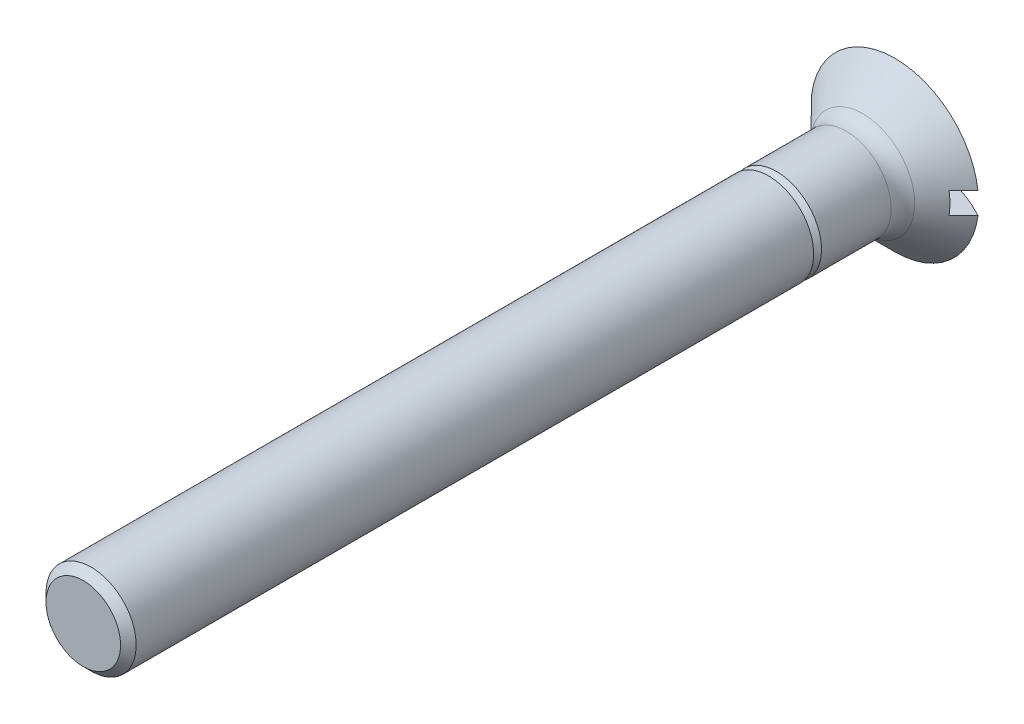
ISO-10303-21;
HEADER;
FILE_DESCRIPTION(('STEP AP214'),'2;1');
FILE_NAME('part.step','',(''),(''),'','','');
FILE_SCHEMA(('AUTOMOTIVE_DESIGN { 1 0 10303 214 1 1 1 1 }'));
ENDSEC;
DATA;
#1=APPLICATION_CONTEXT('core data for automotive mechanical design processes');
#2=APPLICATION_PROTOCOL_DEFINITION('international standard','automotive_design',2000,#1);
#3=PRODUCT_CONTEXT('',#1,'mechanical');
#4=PRODUCT('Part','Part','',(#3));
#5=PRODUCT_RELATED_PRODUCT_CATEGORY('part','',(#4));
#6=PRODUCT_DEFINITION_FORMATION('','',#4);
#7=PRODUCT_DEFINITION_CONTEXT('part definition',#1,'design');
#8=PRODUCT_DEFINITION('design','',#6,#7);
#9=PRODUCT_DEFINITION_SHAPE('','',#8);
#10=(LENGTH_UNIT() NAMED_UNIT(*) SI_UNIT(.MILLI.,.METRE.));
#11=(NAMED_UNIT(*) PLANE_ANGLE_UNIT() SI_UNIT($,.RADIAN.));
#12=(NAMED_UNIT(*) SI_UNIT($,.STERADIAN.) SOLID_ANGLE_UNIT());
#13=UNCERTAINTY_MEASURE_WITH_UNIT(LENGTH_MEASURE(1.E-05),#10,'distance_accuracy_value','');
#14=(GEOMETRIC_REPRESENTATION_CONTEXT(3) GLOBAL_UNCERTAINTY_ASSIGNED_CONTEXT((#13)) GLOBAL_UNIT_ASSIGNED_CONTEXT((#10,
#11,#12)) REPRESENTATION_CONTEXT('',''));
#15=CARTESIAN_POINT('',(0.,0.,0.));
#16=DIRECTION('',(0.,0.,1.));
#17=DIRECTION('',(1.,0.,0.));
#18=AXIS2_PLACEMENT_3D('',#15,#16,#17);
#19=CARTESIAN_POINT('',(0.,0.,9.609375));
#20=DIRECTION('',(0.,0.,-1.));
#21=DIRECTION('',(0.,1.,0.));
#22=AXIS2_PLACEMENT_3D('',#19,#20,#21);
#23=SPHERICAL_SURFACE('',#22,9.609375);
#24=CARTESIAN_POINT('',(0.,0.,1.2));
#25=DIRECTION('',(0.,0.,-1.));
#26=DIRECTION('',(-1.,0.,0.));
#27=AXIS2_PLACEMENT_3D('',#24,#25,#26);
#28=CIRCLE('',#27,4.65);
#29=CARTESIAN_POINT('',(4.61112784468182,-0.6,1.2));
#30=VERTEX_POINT('',#29);
#31=CARTESIAN_POINT('',(-4.61112784468182,-0.6,1.2));
#32=VERTEX_POINT('',#31);
#33=EDGE_CURVE('E125',#30,#32,#28,.T.);
#34=ORIENTED_EDGE('',*,*,#33,.T.);
#35=CARTESIAN_POINT('',(0.,-0.6,9.609375));
#36=DIRECTION('',(0.,-1.,0.));
#37=DIRECTION('',(1.,0.,0.));
#38=AXIS2_PLACEMENT_3D('',#35,#36,#37);
#39=CIRCLE('',#38,9.590625);
#40=EDGE_CURVE('E81',#32,#30,#39,.T.);
#41=ORIENTED_EDGE('',*,*,#40,.T.);
#42=EDGE_LOOP('',(#34,#41));
#43=FACE_BOUND('',#42,.T.);
#44=ADVANCED_FACE('F16',(#43),#23,.T.);
#45=CARTESIAN_POINT('',(0.,0.,46.2));
#46=DIRECTION('',(0.,0.,-1.));
#47=DIRECTION('',(-1.,0.,0.));
#48=AXIS2_PLACEMENT_3D('',#45,#46,#47);
#49=PLANE('',#48);
#50=CARTESIAN_POINT('',(0.,0.,46.2));
#51=DIRECTION('',(0.,0.,-1.));
#52=DIRECTION('',(-1.,0.,0.));
#53=AXIS2_PLACEMENT_3D('',#50,#51,#52);
#54=CIRCLE('',#53,2.067);
#55=CARTESIAN_POINT('',(-2.067,0.,46.2));
#56=VERTEX_POINT('',#55);
#57=EDGE_CURVE('E92',#56,#56,#54,.T.);
#58=ORIENTED_EDGE('',*,*,#57,.F.);
#59=EDGE_LOOP('',(#58));
#60=FACE_BOUND('',#59,.T.);
#61=ADVANCED_FACE('F18',(#60),#49,.F.);
#62=CARTESIAN_POINT('',(0.,0.,46.2));
#63=DIRECTION('',(0.,0.,-1.));
#64=DIRECTION('',(-1.,0.,0.));
#65=AXIS2_PLACEMENT_3D('',#62,#63,#64);
#66=CONICAL_SURFACE('',#65,2.067,0.785398163397455);
#67=CARTESIAN_POINT('',(0.,0.,45.767));
#68=DIRECTION('',(0.,0.,-1.));
#69=DIRECTION('',(-1.,0.,0.));
#70=AXIS2_PLACEMENT_3D('',#67,#68,#69);
#71=CIRCLE('',#70,2.5);
#72=CARTESIAN_POINT('',(-2.5,0.,45.767));
#73=VERTEX_POINT('',#72);
#74=EDGE_CURVE('E98',#73,#73,#71,.T.);
#75=ORIENTED_EDGE('',*,*,#74,.F.);
#76=EDGE_LOOP('',(#75));
#77=FACE_BOUND('',#76,.T.);
#78=ORIENTED_EDGE('',*,*,#57,.T.);
#79=EDGE_LOOP('',(#78));
#80=FACE_BOUND('',#79,.T.);
#81=ADVANCED_FACE('F157',(#77,#80),#66,.T.);
#82=CARTESIAN_POINT('',(0.,0.,0.));
#83=DIRECTION('',(0.,0.,-1.));
#84=DIRECTION('',(-1.,0.,0.));
#85=AXIS2_PLACEMENT_3D('',#82,#83,#84);
#86=CYLINDRICAL_SURFACE('',#85,2.5);
#87=CARTESIAN_POINT('',(0.,0.,8.2));
#88=DIRECTION('',(0.,0.,-1.));
#89=DIRECTION('',(-1.,0.,0.));
#90=AXIS2_PLACEMENT_3D('',#87,#88,#89);
#91=CIRCLE('',#90,2.5);
#92=CARTESIAN_POINT('',(-2.5,0.,8.2));
#93=VERTEX_POINT('',#92);
#94=EDGE_CURVE('E102',#93,#93,#91,.T.);
#95=ORIENTED_EDGE('',*,*,#94,.F.);
#96=EDGE_LOOP('',(#95));
#97=FACE_BOUND('',#96,.T.);
#98=ORIENTED_EDGE('',*,*,#74,.T.);
#99=EDGE_LOOP('',(#98));
#100=FACE_BOUND('',#99,.T.);
#101=ADVANCED_FACE('F185',(#97,#100),#86,.T.);
#102=CARTESIAN_POINT('',(0.,2.5,8.2));
#103=DIRECTION('',(0.,0.,1.));
#104=DIRECTION('',(1.,0.,0.));
#105=AXIS2_PLACEMENT_3D('',#102,#103,#104);
#106=PLANE('',#105);
#107=CARTESIAN_POINT('',(0.,0.,8.2));
#108=DIRECTION('',(0.,0.,-1.));
#109=DIRECTION('',(-1.,0.,0.));
#110=AXIS2_PLACEMENT_3D('',#107,#108,#109);
#111=CIRCLE('',#110,2.067);
#112=CARTESIAN_POINT('',(-2.067,0.,8.2));
#113=VERTEX_POINT('',#112);
#114=EDGE_CURVE('E106',#113,#113,#111,.T.);
#115=ORIENTED_EDGE('',*,*,#114,.F.);
#116=EDGE_LOOP('',(#115));
#117=FACE_BOUND('',#116,.T.);
#118=ORIENTED_EDGE('',*,*,#94,.T.);
#119=EDGE_LOOP('',(#118));
#120=FACE_BOUND('',#119,.T.);
#121=ADVANCED_FACE('F195',(#117,#120),#106,.F.);
#122=CARTESIAN_POINT('',(0.,0.,8.2));
#123=DIRECTION('',(0.,0.,-1.));
#124=DIRECTION('',(-1.,0.,0.));
#125=AXIS2_PLACEMENT_3D('',#122,#123,#124);
#126=CONICAL_SURFACE('',#125,2.067,0.785398163397449);
#127=CARTESIAN_POINT('',(0.,0.,7.767));
#128=DIRECTION('',(0.,0.,-1.));
#129=DIRECTION('',(-1.,0.,0.));
#130=AXIS2_PLACEMENT_3D('',#127,#128,#129);
#131=CIRCLE('',#130,2.5);
#132=CARTESIAN_POINT('',(-2.5,0.,7.767));
#133=VERTEX_POINT('',#132);
#134=EDGE_CURVE('E110',#133,#133,#131,.T.);
#135=ORIENTED_EDGE('',*,*,#134,.F.);
#136=EDGE_LOOP('',(#135));
#137=FACE_BOUND('',#136,.T.);
#138=ORIENTED_EDGE('',*,*,#114,.T.);
#139=EDGE_LOOP('',(#138));
#140=FACE_BOUND('',#139,.T.);
#141=ADVANCED_FACE('F206',(#137,#140),#126,.T.);
#142=CARTESIAN_POINT('',(0.,0.,0.));
#143=DIRECTION('',(0.,0.,-1.));
#144=DIRECTION('',(-1.,0.,0.));
#145=AXIS2_PLACEMENT_3D('',#142,#143,#144);
#146=CYLINDRICAL_SURFACE('',#145,2.5);
#147=CARTESIAN_POINT('',(0.,0.,3.9));
#148=DIRECTION('',(0.,0.,-1.));
#149=DIRECTION('',(-1.,0.,0.));
#150=AXIS2_PLACEMENT_3D('',#147,#148,#149);
#151=CIRCLE('',#150,2.5);
#152=CARTESIAN_POINT('',(-2.5,0.,3.9));
#153=VERTEX_POINT('',#152);
#154=EDGE_CURVE('E114',#153,#153,#151,.T.);
#155=ORIENTED_EDGE('',*,*,#154,.F.);
#156=EDGE_LOOP('',(#155));
#157=FACE_BOUND('',#156,.T.);
#158=ORIENTED_EDGE('',*,*,#134,.T.);
#159=EDGE_LOOP('',(#158));
#160=FACE_BOUND('',#159,.T.);
#161=ADVANCED_FACE('F217',(#157,#160),#146,.T.);
#162=CARTESIAN_POINT('',(0.,0.,3.9));
#163=DIRECTION('',(0.,0.,-1.));
#164=DIRECTION('',(-1.,0.,0.));
#165=AXIS2_PLACEMENT_3D('',#162,#163,#164);
#166=TOROIDAL_SURFACE('',#165,3.8,1.3);
#167=ORIENTED_EDGE('',*,*,#154,.T.);
#168=EDGE_LOOP('',(#167));
#169=FACE_BOUND('',#168,.T.);
#170=CARTESIAN_POINT('',(0.,0.,2.98076118445749));
#171=DIRECTION('',(0.,0.,-1.));
#172=DIRECTION('',(-1.,0.,0.));
#173=AXIS2_PLACEMENT_3D('',#170,#171,#172);
#174=CIRCLE('',#173,2.88076118445749);
#175=CARTESIAN_POINT('',(-2.88076118445749,0.,2.98076118445749));
#176=VERTEX_POINT('',#175);
#177=EDGE_CURVE('E118',#176,#176,#174,.T.);
#178=ORIENTED_EDGE('',*,*,#177,.F.);
#179=EDGE_LOOP('',(#178));
#180=FACE_BOUND('',#179,.T.);
#181=ADVANCED_FACE('F152',(#169,#180),#166,.F.);
#182=CARTESIAN_POINT('',(0.,0.,1.2));
#183=DIRECTION('',(0.,0.,-1.));
#184=DIRECTION('',(-1.,0.,0.));
#185=AXIS2_PLACEMENT_3D('',#182,#183,#184);
#186=CONICAL_SURFACE('',#185,4.65,0.782152437072594);
#187=CARTESIAN_POINT('',(-7.60718248536701,-0.6,-1.80022049699177));
#188=CARTESIAN_POINT('',(-7.31850610940111,-0.6,-1.5105732634803));
#189=CARTESIAN_POINT('',(-7.02978786810209,-0.6,-1.2209677064593));
#190=CARTESIAN_POINT('',(-6.45222335189421,-0.6,-0.641925593146792));
#191=CARTESIAN_POINT('',(-6.16337708761143,-0.6,-0.352489026255514));
#192=CARTESIAN_POINT('',(-5.58552796313503,-0.6,0.226113819990787));
#193=CARTESIAN_POINT('',(-5.29652514506083,-0.6,0.515280141394472));
#194=CARTESIAN_POINT('',(-4.86275019439266,-0.6,0.948777750193976));
#195=CARTESIAN_POINT('',(-4.71810866652522,-0.6,1.0932397168079));
#196=CARTESIAN_POINT('',(-4.42870933735345,-0.6,1.38204936024754));
#197=CARTESIAN_POINT('',(-4.28395153517304,-0.6,1.52639703619555));
#198=CARTESIAN_POINT('',(-3.99422301629322,-0.6,1.81499614782015));
#199=CARTESIAN_POINT('',(-3.84925223705336,-0.6,1.95924752072245));
#200=CARTESIAN_POINT('',(-3.55910112221028,-0.6,2.24753150458704));
#201=CARTESIAN_POINT('',(-3.41392079245338,-0.6,2.3915641214309));
#202=CARTESIAN_POINT('',(-3.12328285200279,-0.6,2.67928757421069));
#203=CARTESIAN_POINT('',(-2.97782530678978,-0.6,2.82297847627333));
#204=CARTESIAN_POINT('',(-2.68643300259924,-0.6,3.10990494536093));
#205=CARTESIAN_POINT('',(-2.54049819826253,-0.6,3.2531404663947));
#206=CARTESIAN_POINT('',(-2.32097249874848,-0.6,3.46746435677861));
#207=CARTESIAN_POINT('',(-2.24766595731088,-0.6,3.53884388264676));
#208=CARTESIAN_POINT('',(-2.10080134448906,-0.6,3.68133979482755));
#209=CARTESIAN_POINT('',(-2.02724328019169,-0.6,3.75245618843849));
#210=CARTESIAN_POINT('',(-1.87980880081097,-0.6,3.89431097215733));
#211=CARTESIAN_POINT('',(-1.80593249560098,-0.6,3.96504947637033));
#212=CARTESIAN_POINT('',(-1.65769485113129,-0.6,4.10603269592859));
#213=CARTESIAN_POINT('',(-1.58333346325995,-0.6,4.17627736027223));
#214=CARTESIAN_POINT('',(-1.43382870405821,-0.6,4.31610341893376));
#215=CARTESIAN_POINT('',(-1.35868453293538,-0.6,4.38568395913863));
#216=CARTESIAN_POINT('',(-1.20735496564957,-0.6,4.52366943566791));
#217=CARTESIAN_POINT('',(-1.13116987026356,-0.6,4.5920746992121));
#218=CARTESIAN_POINT('',(-1.01552359558571,-0.6,4.69322542873626));
#219=CARTESIAN_POINT('',(-0.976720344715935,-0.6,4.72672137192065));
#220=CARTESIAN_POINT('',(-0.898528947778367,-0.6,4.79301339933141));
#221=CARTESIAN_POINT('',(-0.859140890451337,-0.6,4.82580958793723));
#222=CARTESIAN_POINT('',(-0.779528500012262,-0.6,4.8904621219985));
#223=CARTESIAN_POINT('',(-0.739303366464351,-0.6,4.92231749010326));
#224=CARTESIAN_POINT('',(-0.678126849587837,-0.6,4.96902545353781));
#225=CARTESIAN_POINT('',(-0.657589547650278,-0.6,4.9844193692831));
#226=CARTESIAN_POINT('',(-0.616179026242099,-0.6,5.01475478077795));
#227=CARTESIAN_POINT('',(-0.595305754603515,-0.6,5.02969620520815));
#228=CARTESIAN_POINT('',(-0.574237960926196,-0.6,5.04436342326798));
#229=B_SPLINE_CURVE_WITH_KNOTS('',3,(#187,#188,#189,#190,#191,#192,#193,#194,#195,#196,#197,
#198,#199,#200,#201,#202,#203,#204,#205,#206,#207,#208,#209,#210,#211,#212,#213,#214,#215,#216,
#217,#218,#219,#220,#221,#222,#223,#224,#225,#226,#227,#228),.UNSPECIFIED.,.F.,.F.,(4,2,2,2,2,2,
2,2,2,2,2,2,2,2,2,2,2,2,2,2,4),(0.,1.22681140959369,2.45353513348452,3.68001691977813,
4.29329811640169,4.90658397794425,5.52011856641137,6.13363635627417,6.74702376873127,
7.36047127839207,7.66742354580649,7.9743672347436,8.2812123080561,8.58808861869811,
8.89531726179387,9.20245893308511,9.3562354177647,9.50998880158085,9.66389665913891,
9.74088973808933,9.81789488979528),.UNSPECIFIED.);
#230=CARTESIAN_POINT('',(-3.80819969469042,-0.6,2.));
#231=VERTEX_POINT('',#230);
#232=EDGE_CURVE('E67',#32,#231,#229,.T.);
#233=ORIENTED_EDGE('',*,*,#232,.F.);
#234=ORIENTED_EDGE('',*,*,#33,.F.);
#235=CARTESIAN_POINT('',(0.574237960926196,-0.6,5.04436342326798));
#236=CARTESIAN_POINT('',(0.607752171392112,-0.6,5.02100473770217));
#237=CARTESIAN_POINT('',(0.640789093240404,-0.6,4.99698395931376));
#238=CARTESIAN_POINT('',(0.70608597225144,-0.6,4.94793043594317));
#239=CARTESIAN_POINT('',(0.738346214653635,-0.6,4.92289807180488));
#240=CARTESIAN_POINT('',(0.802261918183032,-0.6,4.87213965994261));
#241=CARTESIAN_POINT('',(0.833917920923736,-0.6,4.84641428861158));
#242=CARTESIAN_POINT('',(0.896782358618144,-0.6,4.79441655538387));
#243=CARTESIAN_POINT('',(0.927990745042786,-0.6,4.76814413492378));
#244=CARTESIAN_POINT('',(1.02101940157321,-0.6,4.6887705518368));
#245=CARTESIAN_POINT('',(1.08231472750802,-0.6,4.6350552135253));
#246=CARTESIAN_POINT('',(1.20400914032778,-0.6,4.52658877423359));
#247=CARTESIAN_POINT('',(1.26440794451969,-0.6,4.471837358436));
#248=CARTESIAN_POINT('',(1.44517794441008,-0.6,4.30612420988242));
#249=CARTESIAN_POINT('',(1.56461654150247,-0.6,4.19414719978389));
#250=CARTESIAN_POINT('',(1.80221875179988,-0.6,3.96884778895268));
#251=CARTESIAN_POINT('',(1.92038229773707,-0.6,3.85552531789359));
#252=CARTESIAN_POINT('',(2.1559380356631,-0.6,3.62808724808542));
#253=CARTESIAN_POINT('',(2.27333024640896,-0.6,3.51397166876273));
#254=CARTESIAN_POINT('',(2.50762239447851,-0.6,3.28524307293695));
#255=CARTESIAN_POINT('',(2.62452234383852,-0.6,3.17063006873721));
#256=CARTESIAN_POINT('',(2.97514266888516,-0.6,2.82589882753122));
#257=CARTESIAN_POINT('',(3.20837554139671,-0.6,2.59528498866984));
#258=CARTESIAN_POINT('',(3.67417617498729,-0.6,2.13340181597377));
#259=CARTESIAN_POINT('',(3.90674395554377,-0.6,1.90213250173812));
#260=CARTESIAN_POINT('',(4.42916040634963,-0.6,1.38175633355732));
#261=CARTESIAN_POINT('',(4.71890022353755,-0.6,1.09254020221117));
#262=CARTESIAN_POINT('',(5.29804009959325,-0.6,0.513761688875766));
#263=CARTESIAN_POINT('',(5.58744015458428,-0.6,0.224199303010344));
#264=CARTESIAN_POINT('',(6.16531289236055,-0.6,-0.354427528773157));
#265=CARTESIAN_POINT('',(6.45378610448993,-0.6,-0.643491446079803));
#266=CARTESIAN_POINT('',(7.03058072115541,-0.6,-1.22176346596791));
#267=CARTESIAN_POINT('',(7.31890212755299,-0.6,-1.51097156669249));
#268=CARTESIAN_POINT('',(7.60718248536701,-0.6,-1.80022049699177));
#269=B_SPLINE_CURVE_WITH_KNOTS('',3,(#235,#236,#237,#238,#239,#240,#241,#242,#243,#244,#245,
#246,#247,#248,#249,#250,#251,#252,#253,#254,#255,#256,#257,#258,#259,#260,#261,#262,#263,#264,
#265,#266,#267,#268),.UNSPECIFIED.,.F.,.F.,(4,2,2,2,2,2,2,2,2,2,2,2,2,2,2,2,4),(0.,
0.122527249212104,0.245008791197208,0.36737483485636,0.489754046249444,0.734236514569961,
0.978794502489696,1.46992913789018,1.9610895586167,2.45223799097415,2.9433743436804,
3.92735401825034,4.91130457534552,6.13945543826772,7.36762018101486,8.5927620117389,
9.81788845225337),.UNSPECIFIED.);
#270=CARTESIAN_POINT('',(3.80819969469042,-0.6,2.));
#271=VERTEX_POINT('',#270);
#272=EDGE_CURVE('E40',#271,#30,#269,.T.);
#273=ORIENTED_EDGE('',*,*,#272,.F.);
#274=CARTESIAN_POINT('',(0.,0.,2.));
#275=DIRECTION('',(0.,0.,1.));
#276=DIRECTION('',(1.,0.,0.));
#277=AXIS2_PLACEMENT_3D('',#274,#275,#276);
#278=CIRCLE('',#277,3.85517637918685);
#279=CARTESIAN_POINT('',(3.80819969469042,0.6,2.));
#280=VERTEX_POINT('',#279);
#281=EDGE_CURVE('E20',#280,#271,#278,.F.);
#282=ORIENTED_EDGE('',*,*,#281,.F.);
#283=CARTESIAN_POINT('',(7.60718248536701,0.6,-1.80022049699177));
#284=CARTESIAN_POINT('',(7.31850610940111,0.6,-1.5105732634803));
#285=CARTESIAN_POINT('',(7.02978786810209,0.6,-1.2209677064593));
#286=CARTESIAN_POINT('',(6.45222335189421,0.6,-0.641925593146793));
#287=CARTESIAN_POINT('',(6.16337708761143,0.6,-0.352489026255514));
#288=CARTESIAN_POINT('',(5.58552796313503,0.6,0.226113819990787));
#289=CARTESIAN_POINT('',(5.29652514506083,0.6,0.515280141394471));
#290=CARTESIAN_POINT('',(4.86275019439266,0.6,0.948777750193976));
#291=CARTESIAN_POINT('',(4.71810866652522,0.6,1.0932397168079));
#292=CARTESIAN_POINT('',(4.42870933735344,0.6,1.38204936024754));
#293=CARTESIAN_POINT('',(4.28395153517304,0.6,1.52639703619555));
#294=CARTESIAN_POINT('',(3.99422301629322,0.6,1.81499614782015));
#295=CARTESIAN_POINT('',(3.84925223705336,0.6,1.95924752072245));
#296=CARTESIAN_POINT('',(3.55910112221028,0.6,2.24753150458704));
#297=CARTESIAN_POINT('',(3.41392079245338,0.6,2.3915641214309));
#298=CARTESIAN_POINT('',(3.12328285200279,0.6,2.67928757421069));
#299=CARTESIAN_POINT('',(2.97782530678978,0.6,2.82297847627333));
#300=CARTESIAN_POINT('',(2.68643300259924,0.6,3.10990494536093));
#301=CARTESIAN_POINT('',(2.54049819826253,0.6,3.2531404663947));
#302=CARTESIAN_POINT('',(2.32097249874848,0.6,3.46746435677861));
#303=CARTESIAN_POINT('',(2.24766595731088,0.6,3.53884388264676));
#304=CARTESIAN_POINT('',(2.10080134448906,0.6,3.68133979482755));
#305=CARTESIAN_POINT('',(2.02724328019169,0.6,3.75245618843848));
#306=CARTESIAN_POINT('',(1.87980880081097,0.6,3.89431097215733));
#307=CARTESIAN_POINT('',(1.80593249560098,0.6,3.96504947637033));
#308=CARTESIAN_POINT('',(1.65769485113129,0.6,4.10603269592859));
#309=CARTESIAN_POINT('',(1.58333346325995,0.6,4.17627736027223));
#310=CARTESIAN_POINT('',(1.43382870405821,0.6,4.31610341893376));
#311=CARTESIAN_POINT('',(1.35868453293538,0.6,4.38568395913863));
#312=CARTESIAN_POINT('',(1.20735496564957,0.6,4.52366943566791));
#313=CARTESIAN_POINT('',(1.13116987026356,0.6,4.5920746992121));
#314=CARTESIAN_POINT('',(1.01552359558571,0.6,4.69322542873626));
#315=CARTESIAN_POINT('',(0.976720344715938,0.6,4.72672137192065));
#316=CARTESIAN_POINT('',(0.898528947778369,0.6,4.79301339933141));
#317=CARTESIAN_POINT('',(0.85914089045134,0.6,4.82580958793723));
#318=CARTESIAN_POINT('',(0.779528500012264,0.6,4.89046212199849));
#319=CARTESIAN_POINT('',(0.739303366464353,0.6,4.92231749010326));
#320=CARTESIAN_POINT('',(0.678126849587837,0.6,4.96902545353781));
#321=CARTESIAN_POINT('',(0.657589547650279,0.6,4.9844193692831));
#322=CARTESIAN_POINT('',(0.6161790262421,0.6,5.01475478077795));
#323=CARTESIAN_POINT('',(0.595305754603515,0.6,5.02969620520815));
#324=CARTESIAN_POINT('',(0.574237960926196,0.6,5.04436342326798));
#325=B_SPLINE_CURVE_WITH_KNOTS('',3,(#283,#284,#285,#286,#287,#288,#289,#290,#291,#292,#293,
#294,#295,#296,#297,#298,#299,#300,#301,#302,#303,#304,#305,#306,#307,#308,#309,#310,#311,#312,
#313,#314,#315,#316,#317,#318,#319,#320,#321,#322,#323,#324),.UNSPECIFIED.,.F.,.F.,(4,2,2,2,2,2,
2,2,2,2,2,2,2,2,2,2,2,2,2,2,4),(0.,1.22681140959369,2.45353513348452,3.68001691977813,
4.29329811640169,4.90658397794425,5.52011856641137,6.13363635627416,6.74702376873126,
7.36047127839207,7.66742354580649,7.97436723474359,8.2812123080561,8.5880886186981,
8.89531726179386,9.20245893308511,9.3562354177647,9.50998880158085,9.66389665913891,
9.74088973808933,9.81789488979528),.UNSPECIFIED.);
#326=CARTESIAN_POINT('',(4.61112784468182,0.6,1.2));
#327=VERTEX_POINT('',#326);
#328=EDGE_CURVE('E57',#327,#280,#325,.T.);
#329=ORIENTED_EDGE('',*,*,#328,.F.);
#330=CARTESIAN_POINT('',(-4.61112784468182,0.6,1.2));
#331=VERTEX_POINT('',#330);
#332=EDGE_CURVE('E122',#331,#327,#28,.T.);
#333=ORIENTED_EDGE('',*,*,#332,.F.);
#334=CARTESIAN_POINT('',(-0.574237960926196,0.6,5.04436342326798));
#335=CARTESIAN_POINT('',(-0.607752171392112,0.6,5.02100473770217));
#336=CARTESIAN_POINT('',(-0.640789093240404,0.6,4.99698395931376));
#337=CARTESIAN_POINT('',(-0.706085972251439,0.6,4.94793043594317));
#338=CARTESIAN_POINT('',(-0.738346214653635,0.6,4.92289807180488));
#339=CARTESIAN_POINT('',(-0.802261918183032,0.6,4.87213965994261));
#340=CARTESIAN_POINT('',(-0.833917920923735,0.6,4.84641428861158));
#341=CARTESIAN_POINT('',(-0.896782358618143,0.6,4.79441655538387));
#342=CARTESIAN_POINT('',(-0.927990745042786,0.6,4.76814413492378));
#343=CARTESIAN_POINT('',(-1.02101940157321,0.6,4.6887705518368));
#344=CARTESIAN_POINT('',(-1.08231472750802,0.6,4.6350552135253));
#345=CARTESIAN_POINT('',(-1.20400914032778,0.6,4.52658877423359));
#346=CARTESIAN_POINT('',(-1.26440794451969,0.6,4.471837358436));
#347=CARTESIAN_POINT('',(-1.44517794441008,0.6,4.30612420988242));
#348=CARTESIAN_POINT('',(-1.56461654150247,0.6,4.19414719978389));
#349=CARTESIAN_POINT('',(-1.80221875179988,0.6,3.96884778895268));
#350=CARTESIAN_POINT('',(-1.92038229773707,0.6,3.85552531789359));
#351=CARTESIAN_POINT('',(-2.1559380356631,0.6,3.62808724808542));
#352=CARTESIAN_POINT('',(-2.27333024640896,0.6,3.51397166876273));
#353=CARTESIAN_POINT('',(-2.50762239447851,0.6,3.28524307293695));
#354=CARTESIAN_POINT('',(-2.62452234383852,0.6,3.17063006873721));
#355=CARTESIAN_POINT('',(-2.97514266888516,0.6,2.82589882753122));
#356=CARTESIAN_POINT('',(-3.20837554139671,0.6,2.59528498866984));
#357=CARTESIAN_POINT('',(-3.67417617498729,0.6,2.13340181597377));
#358=CARTESIAN_POINT('',(-3.90674395554377,0.6,1.90213250173812));
#359=CARTESIAN_POINT('',(-4.42916040634963,0.6,1.38175633355732));
#360=CARTESIAN_POINT('',(-4.71890022353755,0.6,1.09254020221117));
#361=CARTESIAN_POINT('',(-5.29804009959325,0.6,0.513761688875768));
#362=CARTESIAN_POINT('',(-5.58744015458428,0.6,0.224199303010345));
#363=CARTESIAN_POINT('',(-6.16531289236055,0.6,-0.354427528773157));
#364=CARTESIAN_POINT('',(-6.45378610448993,0.6,-0.643491446079802));
#365=CARTESIAN_POINT('',(-7.03058072115541,0.6,-1.22176346596791));
#366=CARTESIAN_POINT('',(-7.31890212755299,0.6,-1.5109715666925));
#367=CARTESIAN_POINT('',(-7.60718248536701,0.6,-1.80022049699177));
#368=B_SPLINE_CURVE_WITH_KNOTS('',3,(#334,#335,#336,#337,#338,#339,#340,#341,#342,#343,#344,
#345,#346,#347,#348,#349,#350,#351,#352,#353,#354,#355,#356,#357,#358,#359,#360,#361,#362,#363,
#364,#365,#366,#367),.UNSPECIFIED.,.F.,.F.,(4,2,2,2,2,2,2,2,2,2,2,2,2,2,2,2,4),(0.,
0.122527249212104,0.245008791197208,0.36737483485636,0.489754046249444,0.734236514569961,
0.978794502489697,1.46992913789018,1.9610895586167,2.45223799097415,2.9433743436804,
3.92735401825034,4.91130457534552,6.13945543826772,7.36762018101486,8.5927620117389,
9.81788845225337),.UNSPECIFIED.);
#369=CARTESIAN_POINT('',(-3.80819969469042,0.6,2.));
#370=VERTEX_POINT('',#369);
#371=EDGE_CURVE('E32',#370,#331,#368,.T.);
#372=ORIENTED_EDGE('',*,*,#371,.F.);
#373=EDGE_CURVE('E11',#231,#370,#278,.F.);
#374=ORIENTED_EDGE('',*,*,#373,.F.);
#375=EDGE_LOOP('',(#233,#234,#273,#282,#329,#333,#372,#374));
#376=FACE_BOUND('',#375,.T.);
#377=ORIENTED_EDGE('',*,*,#177,.T.);
#378=EDGE_LOOP('',(#377));
#379=FACE_BOUND('',#378,.T.);
#380=ADVANCED_FACE('F77',(#376,#379),#186,.T.);
#381=ORIENTED_EDGE('',*,*,#332,.T.);
#382=CARTESIAN_POINT('',(0.,0.6,9.609375));
#383=DIRECTION('',(0.,1.,0.));
#384=DIRECTION('',(-1.,0.,0.));
#385=AXIS2_PLACEMENT_3D('',#382,#383,#384);
#386=CIRCLE('',#385,9.590625);
#387=EDGE_CURVE('E61',#327,#331,#386,.T.);
#388=ORIENTED_EDGE('',*,*,#387,.T.);
#389=EDGE_LOOP('',(#381,#388));
#390=FACE_BOUND('',#389,.T.);
#391=ADVANCED_FACE('F142',(#390),#23,.T.);
#392=CARTESIAN_POINT('',(5.65,-0.6,0.5));
#393=DIRECTION('',(0.,-1.,0.));
#394=DIRECTION('',(1.,0.,0.));
#395=AXIS2_PLACEMENT_3D('',#392,#393,#394);
#396=PLANE('',#395);
#397=ORIENTED_EDGE('',*,*,#272,.T.);
#398=ORIENTED_EDGE('',*,*,#40,.F.);
#399=ORIENTED_EDGE('',*,*,#232,.T.);
#400=DIRECTION('',(-1.,0.,0.));
#401=VECTOR('',#400,1.);
#402=CARTESIAN_POINT('',(5.65,-0.6,2.));
#403=LINE('',#402,#401);
#404=EDGE_CURVE('E74',#271,#231,#403,.T.);
#405=ORIENTED_EDGE('',*,*,#404,.F.);
#406=EDGE_LOOP('',(#397,#398,#399,#405));
#407=FACE_BOUND('',#406,.T.);
#408=ADVANCED_FACE('F138',(#407),#396,.F.);
#409=CARTESIAN_POINT('',(5.65,0.6,0.5));
#410=DIRECTION('',(0.,1.,0.));
#411=DIRECTION('',(-1.,0.,0.));
#412=AXIS2_PLACEMENT_3D('',#409,#410,#411);
#413=PLANE('',#412);
#414=ORIENTED_EDGE('',*,*,#328,.T.);
#415=DIRECTION('',(-1.,0.,0.));
#416=VECTOR('',#415,1.);
#417=CARTESIAN_POINT('',(5.65,0.6,2.));
#418=LINE('',#417,#416);
#419=EDGE_CURVE('E60',#280,#370,#418,.T.);
#420=ORIENTED_EDGE('',*,*,#419,.T.);
#421=ORIENTED_EDGE('',*,*,#371,.T.);
#422=ORIENTED_EDGE('',*,*,#387,.F.);
#423=EDGE_LOOP('',(#414,#420,#421,#422));
#424=FACE_BOUND('',#423,.T.);
#425=ADVANCED_FACE('F59',(#424),#413,.F.);
#426=CARTESIAN_POINT('',(5.65,0.,2.));
#427=DIRECTION('',(0.,0.,1.));
#428=DIRECTION('',(1.,0.,0.));
#429=AXIS2_PLACEMENT_3D('',#426,#427,#428);
#430=PLANE('',#429);
#431=ORIENTED_EDGE('',*,*,#373,.T.);
#432=ORIENTED_EDGE('',*,*,#419,.F.);
#433=ORIENTED_EDGE('',*,*,#281,.T.);
#434=ORIENTED_EDGE('',*,*,#404,.T.);
#435=EDGE_LOOP('',(#431,#432,#433,#434));
#436=FACE_BOUND('',#435,.T.);
#437=ADVANCED_FACE('F70',(#436),#430,.F.);
#438=CLOSED_SHELL('',(#44,#61,#81,#101,#121,#141,#161,#181,#380,#391,#408,#425,#437));
#439=MANIFOLD_SOLID_BREP('B1',#438);
#440=ADVANCED_BREP_SHAPE_REPRESENTATION('',(#18,#439),#14);
#441=SHAPE_DEFINITION_REPRESENTATION(#9,#440);
ENDSEC;
END-ISO-10303-21;
